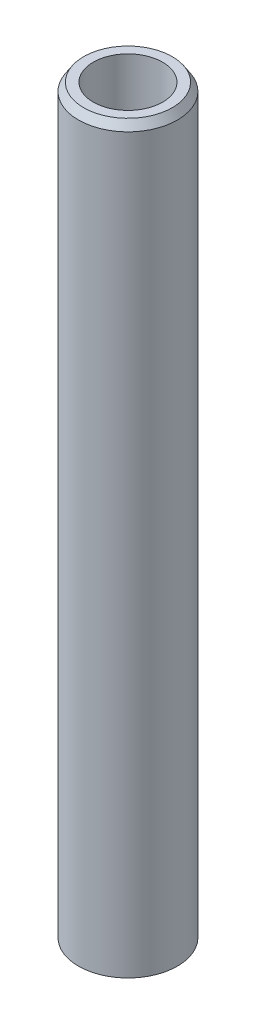
ISO-10303-21;
HEADER;
FILE_DESCRIPTION(('STEP AP214'),'2;1');
FILE_NAME('part.step','',(''),(''),'','','');
FILE_SCHEMA(('AUTOMOTIVE_DESIGN { 1 0 10303 214 1 1 1 1 }'));
ENDSEC;
DATA;
#1=APPLICATION_CONTEXT('core data for automotive mechanical design processes');
#2=APPLICATION_PROTOCOL_DEFINITION('international standard','automotive_design',2000,#1);
#3=PRODUCT_CONTEXT('',#1,'mechanical');
#4=PRODUCT('Part','Part','',(#3));
#5=PRODUCT_RELATED_PRODUCT_CATEGORY('part','',(#4));
#6=PRODUCT_DEFINITION_FORMATION('','',#4);
#7=PRODUCT_DEFINITION_CONTEXT('part definition',#1,'design');
#8=PRODUCT_DEFINITION('design','',#6,#7);
#9=PRODUCT_DEFINITION_SHAPE('','',#8);
#10=(LENGTH_UNIT() NAMED_UNIT(*) SI_UNIT(.MILLI.,.METRE.));
#11=(NAMED_UNIT(*) PLANE_ANGLE_UNIT() SI_UNIT($,.RADIAN.));
#12=(NAMED_UNIT(*) SI_UNIT($,.STERADIAN.) SOLID_ANGLE_UNIT());
#13=UNCERTAINTY_MEASURE_WITH_UNIT(LENGTH_MEASURE(1.E-05),#10,'distance_accuracy_value','');
#14=(GEOMETRIC_REPRESENTATION_CONTEXT(3) GLOBAL_UNCERTAINTY_ASSIGNED_CONTEXT((#13)) GLOBAL_UNIT_ASSIGNED_CONTEXT((#10,
#11,#12)) REPRESENTATION_CONTEXT('',''));
#15=CARTESIAN_POINT('',(0.,0.,0.));
#16=DIRECTION('',(0.,0.,1.));
#17=DIRECTION('',(1.,0.,0.));
#18=AXIS2_PLACEMENT_3D('',#15,#16,#17);
#19=CARTESIAN_POINT('',(0.,376.88859672365,0.));
#20=DIRECTION('',(0.,-1.,0.));
#21=DIRECTION('',(0.,0.,-1.));
#22=AXIS2_PLACEMENT_3D('',#19,#20,#21);
#23=CYLINDRICAL_SURFACE('',#22,25.);
#24=CARTESIAN_POINT('',(0.,372.816637351299,0.));
#25=DIRECTION('',(0.,1.,0.));
#26=DIRECTION('',(0.,0.,1.));
#27=AXIS2_PLACEMENT_3D('',#24,#25,#26);
#28=CIRCLE('',#27,25.);
#29=CARTESIAN_POINT('',(0.,372.816637351299,25.));
#30=VERTEX_POINT('',#29);
#31=EDGE_CURVE('E50',#30,#30,#28,.F.);
#32=ORIENTED_EDGE('',*,*,#31,.T.);
#33=EDGE_LOOP('',(#32));
#34=FACE_BOUND('',#33,.T.);
#35=CARTESIAN_POINT('',(0.,2.63092592607894,0.));
#36=DIRECTION('',(0.,1.,0.));
#37=DIRECTION('',(0.,0.,1.));
#38=AXIS2_PLACEMENT_3D('',#35,#36,#37);
#39=CIRCLE('',#38,25.);
#40=CARTESIAN_POINT('',(0.,2.63092592607894,25.));
#41=VERTEX_POINT('',#40);
#42=EDGE_CURVE('E51',#41,#41,#39,.T.);
#43=ORIENTED_EDGE('',*,*,#42,.T.);
#44=EDGE_LOOP('',(#43));
#45=FACE_BOUND('',#44,.T.);
#46=ADVANCED_FACE('F39',(#34,#45),#23,.T.);
#47=CARTESIAN_POINT('',(0.,376.88859672365,0.));
#48=DIRECTION('',(0.,1.,0.));
#49=DIRECTION('',(0.,0.,1.));
#50=AXIS2_PLACEMENT_3D('',#47,#48,#49);
#51=PLANE('',#50);
#52=CARTESIAN_POINT('',(0.,376.88859672365,0.));
#53=DIRECTION('',(0.,1.,0.));
#54=DIRECTION('',(0.,0.,1.));
#55=AXIS2_PLACEMENT_3D('',#52,#53,#54);
#56=CIRCLE('',#55,22.369074073921);
#57=CARTESIAN_POINT('',(0.,376.88859672365,22.369074073921));
#58=VERTEX_POINT('',#57);
#59=EDGE_CURVE('E54',#58,#58,#56,.T.);
#60=ORIENTED_EDGE('',*,*,#59,.T.);
#61=EDGE_LOOP('',(#60));
#62=FACE_BOUND('',#61,.T.);
#63=CARTESIAN_POINT('',(0.,376.88859672365,0.));
#64=DIRECTION('',(0.,1.,0.));
#65=DIRECTION('',(0.,0.,1.));
#66=AXIS2_PLACEMENT_3D('',#63,#64,#65);
#67=CIRCLE('',#66,17.5171559921829);
#68=CARTESIAN_POINT('',(0.,376.88859672365,17.5171559921829));
#69=VERTEX_POINT('',#68);
#70=EDGE_CURVE('E58',#69,#69,#67,.T.);
#71=ORIENTED_EDGE('',*,*,#70,.F.);
#72=EDGE_LOOP('',(#71));
#73=FACE_BOUND('',#72,.T.);
#74=ADVANCED_FACE('F69',(#62,#73),#51,.T.);
#75=CARTESIAN_POINT('',(0.,0.,0.));
#76=DIRECTION('',(0.,1.,0.));
#77=DIRECTION('',(0.,0.,1.));
#78=AXIS2_PLACEMENT_3D('',#75,#76,#77);
#79=PLANE('',#78);
#80=CARTESIAN_POINT('',(0.,0.,0.));
#81=DIRECTION('',(0.,1.,0.));
#82=DIRECTION('',(0.,0.,1.));
#83=AXIS2_PLACEMENT_3D('',#80,#81,#82);
#84=CIRCLE('',#83,20.9280406276485);
#85=CARTESIAN_POINT('',(0.,0.,20.9280406276485));
#86=VERTEX_POINT('',#85);
#87=EDGE_CURVE('E10',#86,#86,#84,.F.);
#88=ORIENTED_EDGE('',*,*,#87,.T.);
#89=EDGE_LOOP('',(#88));
#90=FACE_BOUND('',#89,.T.);
#91=CARTESIAN_POINT('',(0.,0.,0.));
#92=DIRECTION('',(0.,1.,0.));
#93=DIRECTION('',(0.,0.,1.));
#94=AXIS2_PLACEMENT_3D('',#91,#92,#93);
#95=CIRCLE('',#94,17.5171559921829);
#96=CARTESIAN_POINT('',(0.,0.,17.5171559921829));
#97=VERTEX_POINT('',#96);
#98=EDGE_CURVE('E63',#97,#97,#95,.T.);
#99=ORIENTED_EDGE('',*,*,#98,.T.);
#100=EDGE_LOOP('',(#99));
#101=FACE_BOUND('',#100,.T.);
#102=ADVANCED_FACE('F75',(#90,#101),#79,.F.);
#103=CARTESIAN_POINT('',(0.,376.88859672365,0.));
#104=DIRECTION('',(0.,-1.,0.));
#105=DIRECTION('',(0.,0.,-1.));
#106=AXIS2_PLACEMENT_3D('',#103,#104,#105);
#107=CYLINDRICAL_SURFACE('',#106,17.5171559921829);
#108=ORIENTED_EDGE('',*,*,#70,.T.);
#109=EDGE_LOOP('',(#108));
#110=FACE_BOUND('',#109,.T.);
#111=ORIENTED_EDGE('',*,*,#98,.F.);
#112=EDGE_LOOP('',(#111));
#113=FACE_BOUND('',#112,.T.);
#114=ADVANCED_FACE('F70',(#110,#113),#107,.F.);
#115=CARTESIAN_POINT('',(0.,376.88859672365,0.));
#116=DIRECTION('',(0.,-1.,0.));
#117=DIRECTION('',(0.,0.,-1.));
#118=AXIS2_PLACEMENT_3D('',#115,#116,#117);
#119=CONICAL_SURFACE('',#118,22.369074073921,0.573634394153777);
#120=ORIENTED_EDGE('',*,*,#31,.F.);
#121=EDGE_LOOP('',(#120));
#122=FACE_BOUND('',#121,.T.);
#123=ORIENTED_EDGE('',*,*,#59,.F.);
#124=EDGE_LOOP('',(#123));
#125=FACE_BOUND('',#124,.T.);
#126=ADVANCED_FACE('F81',(#122,#125),#119,.T.);
#127=CARTESIAN_POINT('',(0.,2.63092592607894,0.));
#128=DIRECTION('',(0.,1.,0.));
#129=DIRECTION('',(0.,0.,1.));
#130=AXIS2_PLACEMENT_3D('',#127,#128,#129);
#131=CONICAL_SURFACE('',#130,25.,0.997161932641117);
#132=ORIENTED_EDGE('',*,*,#87,.F.);
#133=EDGE_LOOP('',(#132));
#134=FACE_BOUND('',#133,.T.);
#135=ORIENTED_EDGE('',*,*,#42,.F.);
#136=EDGE_LOOP('',(#135));
#137=FACE_BOUND('',#136,.T.);
#138=ADVANCED_FACE('F45',(#134,#137),#131,.T.);
#139=CLOSED_SHELL('',(#46,#74,#102,#114,#126,#138));
#140=MANIFOLD_SOLID_BREP('B2',#139);
#141=ADVANCED_BREP_SHAPE_REPRESENTATION('',(#18,#140),#14);
#142=SHAPE_DEFINITION_REPRESENTATION(#9,#141);
ENDSEC;
END-ISO-10303-21;
